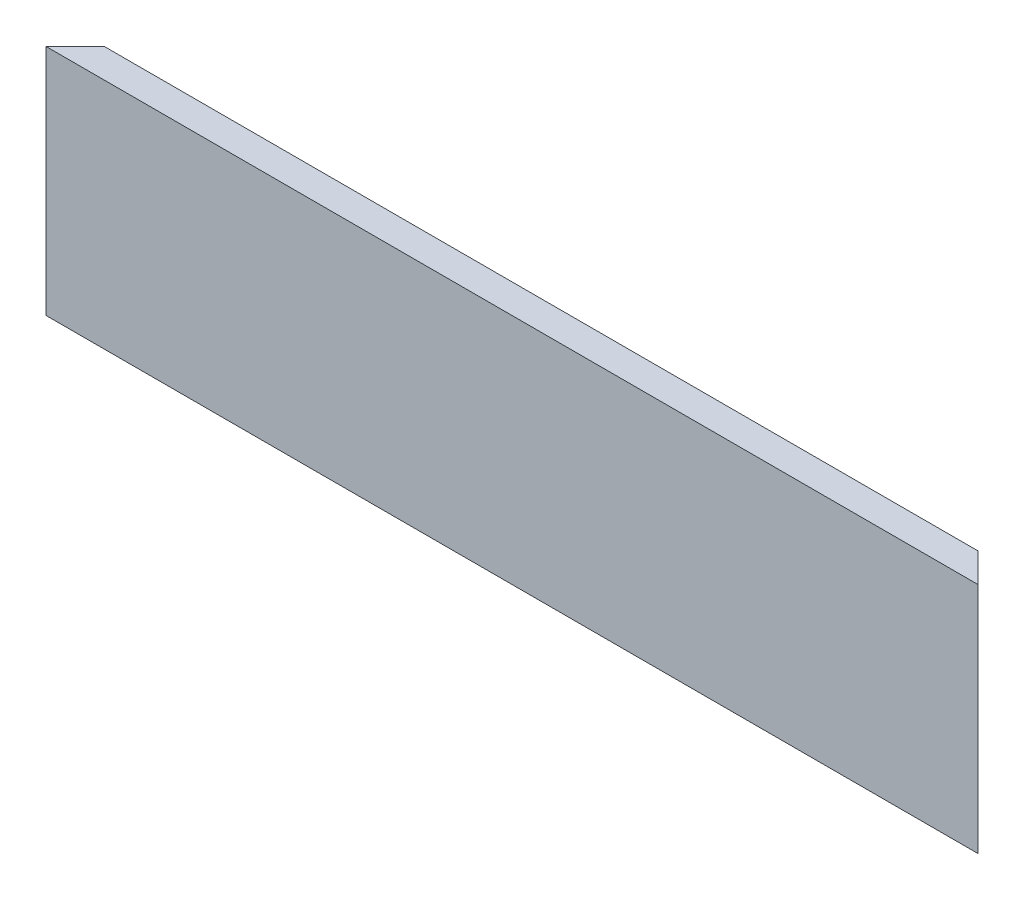
ISO-10303-21;
HEADER;
FILE_DESCRIPTION(('STEP AP214'),'2;1');
FILE_NAME('part.step','',(''),(''),'','','');
FILE_SCHEMA(('AUTOMOTIVE_DESIGN { 1 0 10303 214 1 1 1 1 }'));
ENDSEC;
DATA;
#1=APPLICATION_CONTEXT('core data for automotive mechanical design processes');
#2=APPLICATION_PROTOCOL_DEFINITION('international standard','automotive_design',2000,#1);
#3=PRODUCT_CONTEXT('',#1,'mechanical');
#4=PRODUCT('Part','Part','',(#3));
#5=PRODUCT_RELATED_PRODUCT_CATEGORY('part','',(#4));
#6=PRODUCT_DEFINITION_FORMATION('','',#4);
#7=PRODUCT_DEFINITION_CONTEXT('part definition',#1,'design');
#8=PRODUCT_DEFINITION('design','',#6,#7);
#9=PRODUCT_DEFINITION_SHAPE('','',#8);
#10=(LENGTH_UNIT() NAMED_UNIT(*) SI_UNIT(.MILLI.,.METRE.));
#11=(NAMED_UNIT(*) PLANE_ANGLE_UNIT() SI_UNIT($,.RADIAN.));
#12=(NAMED_UNIT(*) SI_UNIT($,.STERADIAN.) SOLID_ANGLE_UNIT());
#13=UNCERTAINTY_MEASURE_WITH_UNIT(LENGTH_MEASURE(1.E-05),#10,'distance_accuracy_value','');
#14=(GEOMETRIC_REPRESENTATION_CONTEXT(3) GLOBAL_UNCERTAINTY_ASSIGNED_CONTEXT((#13)) GLOBAL_UNIT_ASSIGNED_CONTEXT((#10,
#11,#12)) REPRESENTATION_CONTEXT('',''));
#15=CARTESIAN_POINT('',(0.,0.,0.));
#16=DIRECTION('',(0.,0.,1.));
#17=DIRECTION('',(1.,0.,0.));
#18=AXIS2_PLACEMENT_3D('',#15,#16,#17);
#19=CARTESIAN_POINT('',(50.8000000000002,0.,-25.3999999999995));
#20=DIRECTION('',(0.,1.,0.));
#21=DIRECTION('',(0.,0.,1.00000000000001));
#22=AXIS2_PLACEMENT_3D('',#19,#20,#21);
#23=PLANE('',#22);
#24=DIRECTION('',(-1.,0.,0.));
#25=VECTOR('',#24,1.);
#26=CARTESIAN_POINT('',(50.8000000000013,0.,2.1094237467878E-12));
#27=LINE('',#26,#25);
#28=CARTESIAN_POINT('',(50.8000000000013,0.,2.1094237467878E-12));
#29=VERTEX_POINT('',#28);
#30=CARTESIAN_POINT('',(-50.7999999999997,0.,4.16333634234434E-13));
#31=VERTEX_POINT('',#30);
#32=EDGE_CURVE('E117',#29,#31,#27,.T.);
#33=ORIENTED_EDGE('',*,*,#32,.T.);
#34=DIRECTION('',(0.707106781186545,0.,-0.70710678118655));
#35=VECTOR('',#34,1.);
#36=CARTESIAN_POINT('',(12.6999999999996,1.16573417585641E-12,-63.5000000000005));
#37=LINE('',#36,#35);
#38=CARTESIAN_POINT('',(-25.3999999999999,0.,-25.3999999999995));
#39=VERTEX_POINT('',#38);
#40=EDGE_CURVE('E96',#31,#39,#37,.T.);
#41=ORIENTED_EDGE('',*,*,#40,.T.);
#42=DIRECTION('',(-1.,0.,0.));
#43=VECTOR('',#42,1.);
#44=CARTESIAN_POINT('',(50.8000000000002,0.,-25.3999999999995));
#45=LINE('',#44,#43);
#46=CARTESIAN_POINT('',(25.4000000000001,0.,-25.3999999999995));
#47=VERTEX_POINT('',#46);
#48=EDGE_CURVE('E11',#47,#39,#45,.T.);
#49=ORIENTED_EDGE('',*,*,#48,.F.);
#50=DIRECTION('',(0.707106781186545,0.,0.707106781186556));
#51=VECTOR('',#50,1.);
#52=CARTESIAN_POINT('',(38.1000000000005,0.,-12.6999999999997));
#53=LINE('',#52,#51);
#54=EDGE_CURVE('E103',#47,#29,#53,.T.);
#55=ORIENTED_EDGE('',*,*,#54,.T.);
#56=EDGE_LOOP('',(#33,#41,#49,#55));
#57=FACE_BOUND('',#56,.T.);
#58=ADVANCED_FACE('F42',(#57),#23,.F.);
#59=CARTESIAN_POINT('',(50.8000000000002,3.17499999999998,-25.3999999999995));
#60=DIRECTION('',(0.,0.,1.00000000000001));
#61=DIRECTION('',(1.,0.,0.));
#62=AXIS2_PLACEMENT_3D('',#59,#60,#61);
#63=PLANE('',#62);
#64=ORIENTED_EDGE('',*,*,#48,.T.);
#65=DIRECTION('',(0.,1.,0.));
#66=VECTOR('',#65,1.);
#67=CARTESIAN_POINT('',(-25.3999999999999,-1.19999999936837E-05,-25.3999999999995));
#68=LINE('',#67,#66);
#69=CARTESIAN_POINT('',(-25.4000000000003,3.17500000000009,-25.3999999999997));
#70=VERTEX_POINT('',#69);
#71=EDGE_CURVE('E113',#39,#70,#68,.T.);
#72=ORIENTED_EDGE('',*,*,#71,.T.);
#73=DIRECTION('',(-1.,0.,0.));
#74=VECTOR('',#73,1.);
#75=CARTESIAN_POINT('',(50.8000000000002,3.17499999999998,-25.3999999999995));
#76=LINE('',#75,#74);
#77=CARTESIAN_POINT('',(25.4000000000001,3.17499999999998,-25.3999999999997));
#78=VERTEX_POINT('',#77);
#79=EDGE_CURVE('E51',#78,#70,#76,.T.);
#80=ORIENTED_EDGE('',*,*,#79,.F.);
#81=DIRECTION('',(0.,1.,0.));
#82=VECTOR('',#81,1.);
#83=CARTESIAN_POINT('',(25.4000000000001,-1.19999999936837E-05,-25.3999999999995));
#84=LINE('',#83,#82);
#85=EDGE_CURVE('E143',#47,#78,#84,.T.);
#86=ORIENTED_EDGE('',*,*,#85,.F.);
#87=EDGE_LOOP('',(#64,#72,#80,#86));
#88=FACE_BOUND('',#87,.T.);
#89=ADVANCED_FACE('F142',(#88),#63,.F.);
#90=CARTESIAN_POINT('',(50.8,3.17499999999998,-3.17499999999984));
#91=DIRECTION('',(0.,-1.,0.));
#92=DIRECTION('',(0.,0.,-1.00000000000001));
#93=AXIS2_PLACEMENT_3D('',#90,#91,#92);
#94=PLANE('',#93);
#95=ORIENTED_EDGE('',*,*,#79,.T.);
#96=DIRECTION('',(-0.707106781186545,0.,0.70710678118655));
#97=VECTOR('',#96,1.);
#98=CARTESIAN_POINT('',(1.58749999999969,3.17500000000115,-52.387499999999));
#99=LINE('',#98,#97);
#100=CARTESIAN_POINT('',(-47.625,3.17499999999998,-3.1749999999999));
#101=VERTEX_POINT('',#100);
#102=EDGE_CURVE('E137',#70,#101,#99,.T.);
#103=ORIENTED_EDGE('',*,*,#102,.T.);
#104=DIRECTION('',(-1.,0.,0.));
#105=VECTOR('',#104,1.);
#106=CARTESIAN_POINT('',(50.8,3.17499999999998,-3.17499999999984));
#107=LINE('',#106,#105);
#108=CARTESIAN_POINT('',(47.6249999999998,3.17499999999998,-3.17499999999971));
#109=VERTEX_POINT('',#108);
#110=EDGE_CURVE('E122',#109,#101,#107,.T.);
#111=ORIENTED_EDGE('',*,*,#110,.F.);
#112=DIRECTION('',(-0.707106781186545,0.,-0.707106781186556));
#113=VECTOR('',#112,1.);
#114=CARTESIAN_POINT('',(49.2125000000005,3.17499999999998,-1.58749999999877));
#115=LINE('',#114,#113);
#116=EDGE_CURVE('E138',#109,#78,#115,.T.);
#117=ORIENTED_EDGE('',*,*,#116,.T.);
#118=EDGE_LOOP('',(#95,#103,#111,#117));
#119=FACE_BOUND('',#118,.T.);
#120=ADVANCED_FACE('F135',(#119),#94,.F.);
#121=CARTESIAN_POINT('',(50.8000000000003,25.4,-3.1749999999994));
#122=DIRECTION('',(0.,0.,1.00000000000001));
#123=DIRECTION('',(0.,-1.,0.));
#124=AXIS2_PLACEMENT_3D('',#121,#122,#123);
#125=PLANE('',#124);
#126=ORIENTED_EDGE('',*,*,#110,.T.);
#127=DIRECTION('',(0.,1.,0.));
#128=VECTOR('',#127,1.);
#129=CARTESIAN_POINT('',(-47.6250000000002,25.4,-3.17499999999926));
#130=LINE('',#129,#128);
#131=CARTESIAN_POINT('',(-47.6250000000002,25.4,-3.17499999999926));
#132=VERTEX_POINT('',#131);
#133=EDGE_CURVE('E146',#101,#132,#130,.T.);
#134=ORIENTED_EDGE('',*,*,#133,.T.);
#135=DIRECTION('',(-1.,0.,0.));
#136=VECTOR('',#135,1.);
#137=CARTESIAN_POINT('',(50.8000000000003,25.4,-3.1749999999994));
#138=LINE('',#137,#136);
#139=CARTESIAN_POINT('',(47.6250000000002,25.4,-3.17500000000029));
#140=VERTEX_POINT('',#139);
#141=EDGE_CURVE('E111',#140,#132,#138,.T.);
#142=ORIENTED_EDGE('',*,*,#141,.F.);
#143=DIRECTION('',(0.,-1.,0.));
#144=VECTOR('',#143,1.);
#145=CARTESIAN_POINT('',(47.6250000000002,25.4,-3.17500000000029));
#146=LINE('',#145,#144);
#147=EDGE_CURVE('E160',#140,#109,#146,.T.);
#148=ORIENTED_EDGE('',*,*,#147,.T.);
#149=EDGE_LOOP('',(#126,#134,#142,#148));
#150=FACE_BOUND('',#149,.T.);
#151=ADVANCED_FACE('F180',(#150),#125,.F.);
#152=CARTESIAN_POINT('',(50.8000000000001,25.4,3.05311331771918E-13));
#153=DIRECTION('',(0.,-1.,0.));
#154=DIRECTION('',(0.,0.,-1.00000000000001));
#155=AXIS2_PLACEMENT_3D('',#152,#153,#154);
#156=PLANE('',#155);
#157=ORIENTED_EDGE('',*,*,#141,.T.);
#158=DIRECTION('',(0.707106781186545,0.,-0.70710678118655));
#159=VECTOR('',#158,1.);
#160=CARTESIAN_POINT('',(-50.7999999999998,25.4,3.33066907387547E-13));
#161=LINE('',#160,#159);
#162=CARTESIAN_POINT('',(-50.7999999999998,25.4,3.33066907387547E-13));
#163=VERTEX_POINT('',#162);
#164=EDGE_CURVE('E93',#163,#132,#161,.T.);
#165=ORIENTED_EDGE('',*,*,#164,.F.);
#166=DIRECTION('',(-1.,0.,0.));
#167=VECTOR('',#166,1.);
#168=CARTESIAN_POINT('',(50.8000000000001,25.4,3.05311331771918E-13));
#169=LINE('',#168,#167);
#170=CARTESIAN_POINT('',(50.8000000000001,25.4,3.05311331771918E-13));
#171=VERTEX_POINT('',#170);
#172=EDGE_CURVE('E108',#171,#163,#169,.T.);
#173=ORIENTED_EDGE('',*,*,#172,.F.);
#174=DIRECTION('',(0.707106781186545,0.,0.707106781186556));
#175=VECTOR('',#174,1.);
#176=CARTESIAN_POINT('',(25.4000000000007,25.4,-25.3999999999997));
#177=LINE('',#176,#175);
#178=EDGE_CURVE('E57',#140,#171,#177,.T.);
#179=ORIENTED_EDGE('',*,*,#178,.F.);
#180=EDGE_LOOP('',(#157,#165,#173,#179));
#181=FACE_BOUND('',#180,.T.);
#182=ADVANCED_FACE('F107',(#181),#156,.F.);
#183=CARTESIAN_POINT('',(50.8000000000013,0.,2.1094237467878E-12));
#184=DIRECTION('',(0.,0.,-1.00000000000001));
#185=DIRECTION('',(-1.,0.,0.));
#186=AXIS2_PLACEMENT_3D('',#183,#184,#185);
#187=PLANE('',#186);
#188=DIRECTION('',(0.,-1.,0.));
#189=VECTOR('',#188,1.);
#190=CARTESIAN_POINT('',(-50.7999999999997,0.,4.16333634234434E-13));
#191=LINE('',#190,#189);
#192=EDGE_CURVE('E90',#163,#31,#191,.T.);
#193=ORIENTED_EDGE('',*,*,#192,.T.);
#194=ORIENTED_EDGE('',*,*,#32,.F.);
#195=DIRECTION('',(0.,-1.,0.));
#196=VECTOR('',#195,1.);
#197=CARTESIAN_POINT('',(50.8000000000013,0.,2.1094237467878E-12));
#198=LINE('',#197,#196);
#199=EDGE_CURVE('E102',#171,#29,#198,.T.);
#200=ORIENTED_EDGE('',*,*,#199,.F.);
#201=ORIENTED_EDGE('',*,*,#172,.T.);
#202=EDGE_LOOP('',(#193,#194,#200,#201));
#203=FACE_BOUND('',#202,.T.);
#204=ADVANCED_FACE('F115',(#203),#187,.F.);
#205=CARTESIAN_POINT('',(-50.7999999999997,-1.19999999936837E-05,4.16333634234434E-13));
#206=DIRECTION('',(0.70710678118655,0.,0.707106781186547));
#207=DIRECTION('',(0.707106781186545,0.,-0.70710678118655));
#208=AXIS2_PLACEMENT_3D('',#205,#206,#207);
#209=PLANE('',#208);
#210=ORIENTED_EDGE('',*,*,#192,.F.);
#211=ORIENTED_EDGE('',*,*,#164,.T.);
#212=ORIENTED_EDGE('',*,*,#133,.F.);
#213=ORIENTED_EDGE('',*,*,#102,.F.);
#214=ORIENTED_EDGE('',*,*,#71,.F.);
#215=ORIENTED_EDGE('',*,*,#40,.F.);
#216=EDGE_LOOP('',(#210,#211,#212,#213,#214,#215));
#217=FACE_BOUND('',#216,.T.);
#218=ADVANCED_FACE('F92',(#217),#209,.F.);
#219=CARTESIAN_POINT('',(25.4000000000001,-1.19999999936837E-05,-25.3999999999995));
#220=DIRECTION('',(-0.70710678118655,0.,0.707106781186545));
#221=DIRECTION('',(0.707106781186545,0.,0.707106781186556));
#222=AXIS2_PLACEMENT_3D('',#219,#220,#221);
#223=PLANE('',#222);
#224=ORIENTED_EDGE('',*,*,#85,.T.);
#225=ORIENTED_EDGE('',*,*,#116,.F.);
#226=ORIENTED_EDGE('',*,*,#147,.F.);
#227=ORIENTED_EDGE('',*,*,#178,.T.);
#228=ORIENTED_EDGE('',*,*,#199,.T.);
#229=ORIENTED_EDGE('',*,*,#54,.F.);
#230=EDGE_LOOP('',(#224,#225,#226,#227,#228,#229));
#231=FACE_BOUND('',#230,.T.);
#232=ADVANCED_FACE('F171',(#231),#223,.F.);
#233=CLOSED_SHELL('',(#58,#89,#120,#151,#182,#204,#218,#232));
#234=MANIFOLD_SOLID_BREP('B2',#233);
#235=ADVANCED_BREP_SHAPE_REPRESENTATION('',(#18,#234),#14);
#236=SHAPE_DEFINITION_REPRESENTATION(#9,#235);
ENDSEC;
END-ISO-10303-21;
